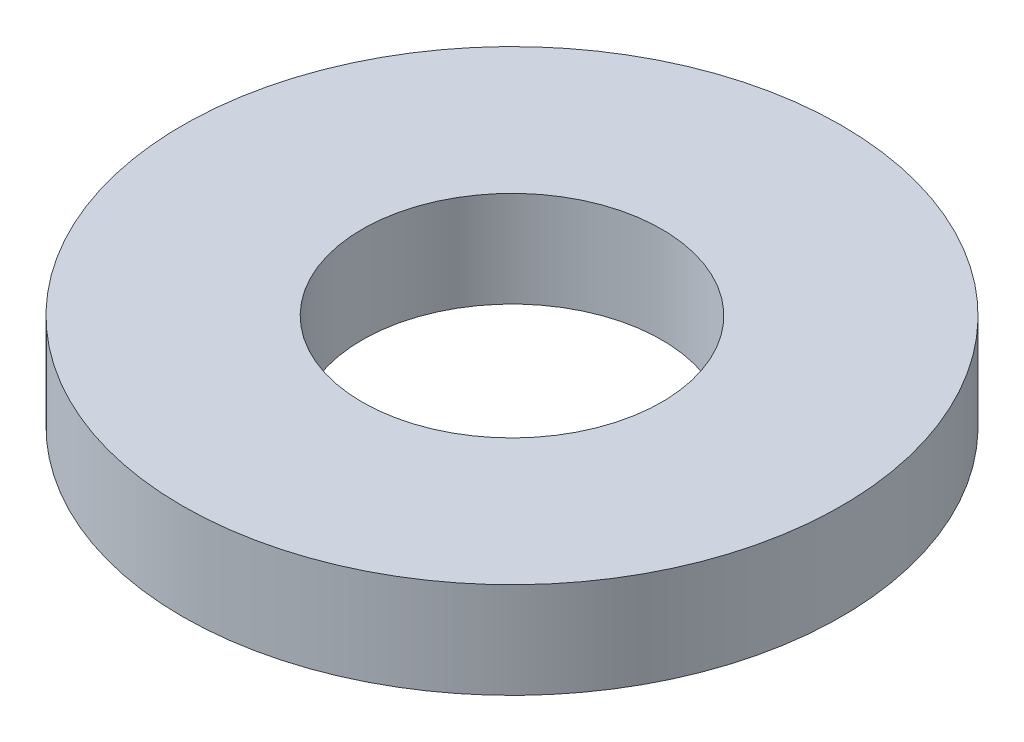
ISO-10303-21;
HEADER;
FILE_DESCRIPTION(('STEP AP214'),'2;1');
FILE_NAME('part.step','',(''),(''),'','','');
FILE_SCHEMA(('AUTOMOTIVE_DESIGN { 1 0 10303 214 1 1 1 1 }'));
ENDSEC;
DATA;
#1=APPLICATION_CONTEXT('core data for automotive mechanical design processes');
#2=APPLICATION_PROTOCOL_DEFINITION('international standard','automotive_design',2000,#1);
#3=PRODUCT_CONTEXT('',#1,'mechanical');
#4=PRODUCT('Part','Part','',(#3));
#5=PRODUCT_RELATED_PRODUCT_CATEGORY('part','',(#4));
#6=PRODUCT_DEFINITION_FORMATION('','',#4);
#7=PRODUCT_DEFINITION_CONTEXT('part definition',#1,'design');
#8=PRODUCT_DEFINITION('design','',#6,#7);
#9=PRODUCT_DEFINITION_SHAPE('','',#8);
#10=(LENGTH_UNIT() NAMED_UNIT(*) SI_UNIT(.MILLI.,.METRE.));
#11=(NAMED_UNIT(*) PLANE_ANGLE_UNIT() SI_UNIT($,.RADIAN.));
#12=(NAMED_UNIT(*) SI_UNIT($,.STERADIAN.) SOLID_ANGLE_UNIT());
#13=UNCERTAINTY_MEASURE_WITH_UNIT(LENGTH_MEASURE(1.E-05),#10,'distance_accuracy_value','');
#14=(GEOMETRIC_REPRESENTATION_CONTEXT(3) GLOBAL_UNCERTAINTY_ASSIGNED_CONTEXT((#13)) GLOBAL_UNIT_ASSIGNED_CONTEXT((#10,
#11,#12)) REPRESENTATION_CONTEXT('',''));
#15=CARTESIAN_POINT('',(0.,0.,0.));
#16=DIRECTION('',(0.,0.,1.));
#17=DIRECTION('',(1.,0.,0.));
#18=AXIS2_PLACEMENT_3D('',#15,#16,#17);
#19=CARTESIAN_POINT('',(0.,24.,0.));
#20=DIRECTION('',(0.,-1.,0.));
#21=DIRECTION('',(0.,0.,-1.));
#22=AXIS2_PLACEMENT_3D('',#19,#20,#21);
#23=CYLINDRICAL_SURFACE('',#22,82.5);
#24=CARTESIAN_POINT('',(0.,24.,0.));
#25=DIRECTION('',(0.,1.,0.));
#26=DIRECTION('',(0.,0.,1.));
#27=AXIS2_PLACEMENT_3D('',#24,#25,#26);
#28=CIRCLE('',#27,82.5);
#29=CARTESIAN_POINT('',(0.,24.,82.5));
#30=VERTEX_POINT('',#29);
#31=EDGE_CURVE('E10',#30,#30,#28,.T.);
#32=ORIENTED_EDGE('',*,*,#31,.F.);
#33=EDGE_LOOP('',(#32));
#34=FACE_BOUND('',#33,.T.);
#35=CARTESIAN_POINT('',(0.,0.,0.));
#36=DIRECTION('',(0.,1.,0.));
#37=DIRECTION('',(0.,0.,1.));
#38=AXIS2_PLACEMENT_3D('',#35,#36,#37);
#39=CIRCLE('',#38,82.5);
#40=CARTESIAN_POINT('',(0.,0.,82.5));
#41=VERTEX_POINT('',#40);
#42=EDGE_CURVE('E37',#41,#41,#39,.T.);
#43=ORIENTED_EDGE('',*,*,#42,.T.);
#44=EDGE_LOOP('',(#43));
#45=FACE_BOUND('',#44,.T.);
#46=ADVANCED_FACE('F40',(#34,#45),#23,.T.);
#47=CARTESIAN_POINT('',(0.,24.,0.));
#48=DIRECTION('',(0.,1.,0.));
#49=DIRECTION('',(0.,0.,1.));
#50=AXIS2_PLACEMENT_3D('',#47,#48,#49);
#51=PLANE('',#50);
#52=CARTESIAN_POINT('',(0.,24.,0.));
#53=DIRECTION('',(0.,1.,0.));
#54=DIRECTION('',(0.,0.,1.));
#55=AXIS2_PLACEMENT_3D('',#52,#53,#54);
#56=CIRCLE('',#55,37.5);
#57=CARTESIAN_POINT('',(0.,24.,37.5));
#58=VERTEX_POINT('',#57);
#59=EDGE_CURVE('E50',#58,#58,#56,.T.);
#60=ORIENTED_EDGE('',*,*,#59,.F.);
#61=EDGE_LOOP('',(#60));
#62=FACE_BOUND('',#61,.T.);
#63=ORIENTED_EDGE('',*,*,#31,.T.);
#64=EDGE_LOOP('',(#63));
#65=FACE_BOUND('',#64,.T.);
#66=ADVANCED_FACE('F59',(#62,#65),#51,.T.);
#67=CARTESIAN_POINT('',(0.,0.,0.));
#68=DIRECTION('',(0.,1.,0.));
#69=DIRECTION('',(0.,0.,1.));
#70=AXIS2_PLACEMENT_3D('',#67,#68,#69);
#71=PLANE('',#70);
#72=CARTESIAN_POINT('',(0.,0.,0.));
#73=DIRECTION('',(0.,1.,0.));
#74=DIRECTION('',(0.,0.,1.));
#75=AXIS2_PLACEMENT_3D('',#72,#73,#74);
#76=CIRCLE('',#75,37.5);
#77=CARTESIAN_POINT('',(0.,0.,37.5));
#78=VERTEX_POINT('',#77);
#79=EDGE_CURVE('E47',#78,#78,#76,.T.);
#80=ORIENTED_EDGE('',*,*,#79,.T.);
#81=EDGE_LOOP('',(#80));
#82=FACE_BOUND('',#81,.T.);
#83=ORIENTED_EDGE('',*,*,#42,.F.);
#84=EDGE_LOOP('',(#83));
#85=FACE_BOUND('',#84,.T.);
#86=ADVANCED_FACE('F58',(#82,#85),#71,.F.);
#87=CARTESIAN_POINT('',(0.,24.,0.));
#88=DIRECTION('',(0.,-1.,0.));
#89=DIRECTION('',(0.,0.,-1.));
#90=AXIS2_PLACEMENT_3D('',#87,#88,#89);
#91=CYLINDRICAL_SURFACE('',#90,37.5);
#92=ORIENTED_EDGE('',*,*,#59,.T.);
#93=EDGE_LOOP('',(#92));
#94=FACE_BOUND('',#93,.T.);
#95=ORIENTED_EDGE('',*,*,#79,.F.);
#96=EDGE_LOOP('',(#95));
#97=FACE_BOUND('',#96,.T.);
#98=ADVANCED_FACE('F54',(#94,#97),#91,.F.);
#99=CLOSED_SHELL('',(#46,#66,#86,#98));
#100=MANIFOLD_SOLID_BREP('B2',#99);
#101=ADVANCED_BREP_SHAPE_REPRESENTATION('',(#18,#100),#14);
#102=SHAPE_DEFINITION_REPRESENTATION(#9,#101);
ENDSEC;
END-ISO-10303-21;
